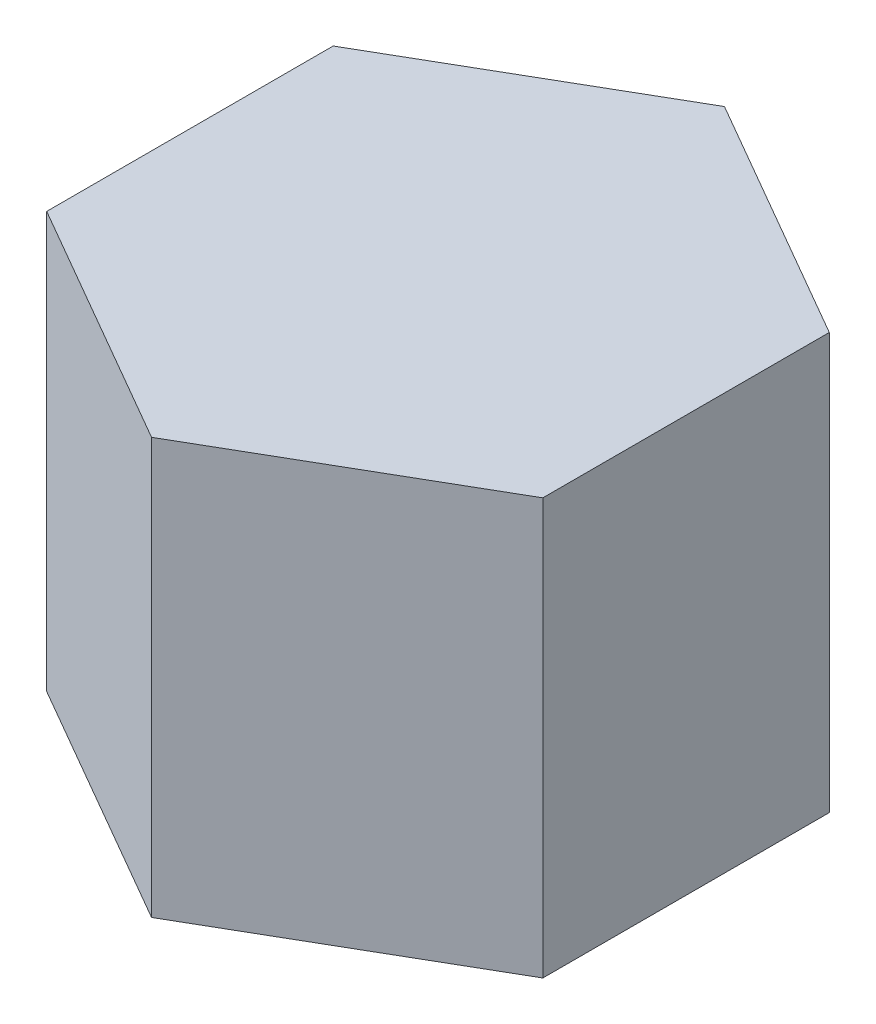
ISO-10303-21;
HEADER;
FILE_DESCRIPTION(('STEP AP214'),'2;1');
FILE_NAME('part.step','',(''),(''),'','','');
FILE_SCHEMA(('AUTOMOTIVE_DESIGN { 1 0 10303 214 1 1 1 1 }'));
ENDSEC;
DATA;
#1=APPLICATION_CONTEXT('core data for automotive mechanical design processes');
#2=APPLICATION_PROTOCOL_DEFINITION('international standard','automotive_design',2000,#1);
#3=PRODUCT_CONTEXT('',#1,'mechanical');
#4=PRODUCT('Part','Part','',(#3));
#5=PRODUCT_RELATED_PRODUCT_CATEGORY('part','',(#4));
#6=PRODUCT_DEFINITION_FORMATION('','',#4);
#7=PRODUCT_DEFINITION_CONTEXT('part definition',#1,'design');
#8=PRODUCT_DEFINITION('design','',#6,#7);
#9=PRODUCT_DEFINITION_SHAPE('','',#8);
#10=(LENGTH_UNIT() NAMED_UNIT(*) SI_UNIT(.MILLI.,.METRE.));
#11=(NAMED_UNIT(*) PLANE_ANGLE_UNIT() SI_UNIT($,.RADIAN.));
#12=(NAMED_UNIT(*) SI_UNIT($,.STERADIAN.) SOLID_ANGLE_UNIT());
#13=UNCERTAINTY_MEASURE_WITH_UNIT(LENGTH_MEASURE(1.E-05),#10,'distance_accuracy_value','');
#14=(GEOMETRIC_REPRESENTATION_CONTEXT(3) GLOBAL_UNCERTAINTY_ASSIGNED_CONTEXT((#13)) GLOBAL_UNIT_ASSIGNED_CONTEXT((#10,
#11,#12)) REPRESENTATION_CONTEXT('',''));
#15=CARTESIAN_POINT('',(0.,0.,0.));
#16=DIRECTION('',(0.,0.,1.));
#17=DIRECTION('',(1.,0.,0.));
#18=AXIS2_PLACEMENT_3D('',#15,#16,#17);
#19=CARTESIAN_POINT('',(206.642660308706,-148.537700895744,288.042869605357));
#20=DIRECTION('',(-0.499999999999943,0.,-0.866025403784472));
#21=DIRECTION('',(-0.866025403784472,0.,0.499999999999943));
#22=AXIS2_PLACEMENT_3D('',#19,#20,#21);
#23=PLANE('',#22);
#24=CARTESIAN_POINT('',(206.339551417382,-149.045793579175,288.217869605357));
#25=DIRECTION('',(0.866025403784471,0.,-0.499999999999943));
#26=VECTOR('',#25,1.);
#27=LINE('',#24,#26);
#28=CARTESIAN_POINT('',(206.339551417382,-149.045793579175,288.217869605357));
#29=VERTEX_POINT('',#28);
#30=CARTESIAN_POINT('',(206.642660308706,-149.045793579175,288.042869605357));
#31=VERTEX_POINT('',#30);
#32=EDGE_CURVE('E170',#29,#31,#27,.T.);
#33=ORIENTED_EDGE('',*,*,#32,.T.);
#34=CARTESIAN_POINT('',(206.642660308706,-148.537700895744,288.042869605357));
#35=DIRECTION('',(0.,-1.,0.));
#36=VECTOR('',#35,1.);
#37=LINE('',#34,#36);
#38=CARTESIAN_POINT('',(206.642660308706,-148.537700895744,288.042869605357));
#39=VERTEX_POINT('',#38);
#40=EDGE_CURVE('E35',#39,#31,#37,.T.);
#41=ORIENTED_EDGE('',*,*,#40,.F.);
#42=CARTESIAN_POINT('',(206.339551417382,-148.537700895744,288.217869605357));
#43=DIRECTION('',(0.866025403784471,0.,-0.499999999999943));
#44=VECTOR('',#43,1.);
#45=LINE('',#42,#44);
#46=CARTESIAN_POINT('',(206.339551417382,-148.537700895744,288.217869605357));
#47=VERTEX_POINT('',#46);
#48=EDGE_CURVE('E159',#47,#39,#45,.T.);
#49=ORIENTED_EDGE('',*,*,#48,.F.);
#50=CARTESIAN_POINT('',(206.339551417382,-148.537700895744,288.217869605357));
#51=DIRECTION('',(0.,-1.,0.));
#52=VECTOR('',#51,1.);
#53=LINE('',#50,#52);
#54=EDGE_CURVE('E10',#47,#29,#53,.T.);
#55=ORIENTED_EDGE('',*,*,#54,.T.);
#56=EDGE_LOOP('',(#33,#41,#49,#55));
#57=FACE_BOUND('',#56,.T.);
#58=ADVANCED_FACE('F16',(#57),#23,.F.);
#59=CARTESIAN_POINT('',(206.339551417382,-148.537700895744,288.217869605357));
#60=DIRECTION('',(0.499999999999978,0.,-0.866025403784452));
#61=DIRECTION('',(-0.866025403784452,0.,-0.499999999999978));
#62=AXIS2_PLACEMENT_3D('',#59,#60,#61);
#63=PLANE('',#62);
#64=CARTESIAN_POINT('',(206.036442526057,-149.045793579175,288.042869605357));
#65=DIRECTION('',(0.866025403784452,0.,0.499999999999978));
#66=VECTOR('',#65,1.);
#67=LINE('',#64,#66);
#68=CARTESIAN_POINT('',(206.036442526057,-149.045793579175,288.042869605357));
#69=VERTEX_POINT('',#68);
#70=EDGE_CURVE('E167',#69,#29,#67,.T.);
#71=ORIENTED_EDGE('',*,*,#70,.T.);
#72=ORIENTED_EDGE('',*,*,#54,.F.);
#73=CARTESIAN_POINT('',(206.036442526057,-148.537700895744,288.042869605357));
#74=DIRECTION('',(0.866025403784452,0.,0.499999999999978));
#75=VECTOR('',#74,1.);
#76=LINE('',#73,#75);
#77=CARTESIAN_POINT('',(206.036442526057,-148.537700895744,288.042869605357));
#78=VERTEX_POINT('',#77);
#79=EDGE_CURVE('E156',#78,#47,#76,.T.);
#80=ORIENTED_EDGE('',*,*,#79,.F.);
#81=CARTESIAN_POINT('',(206.036442526057,-148.537700895744,288.042869605357));
#82=DIRECTION('',(0.,-1.,0.));
#83=VECTOR('',#82,1.);
#84=LINE('',#81,#83);
#85=EDGE_CURVE('E27',#78,#69,#84,.T.);
#86=ORIENTED_EDGE('',*,*,#85,.T.);
#87=EDGE_LOOP('',(#71,#72,#80,#86));
#88=FACE_BOUND('',#87,.T.);
#89=ADVANCED_FACE('F189',(#88),#63,.F.);
#90=CARTESIAN_POINT('',(206.036442526057,-148.537700895744,290.831971220494));
#91=DIRECTION('',(1.,0.,0.));
#92=DIRECTION('',(0.,1.,0.));
#93=AXIS2_PLACEMENT_3D('',#90,#91,#92);
#94=PLANE('',#93);
#95=CARTESIAN_POINT('',(206.036442526057,-149.045793579175,287.692869605357));
#96=DIRECTION('',(0.,0.,1.));
#97=VECTOR('',#96,1.);
#98=LINE('',#95,#97);
#99=CARTESIAN_POINT('',(206.036442526057,-149.045793579175,287.692869605357));
#100=VERTEX_POINT('',#99);
#101=EDGE_CURVE('E163',#100,#69,#98,.T.);
#102=ORIENTED_EDGE('',*,*,#101,.T.);
#103=ORIENTED_EDGE('',*,*,#85,.F.);
#104=CARTESIAN_POINT('',(206.036442526057,-148.537700895744,287.692869605357));
#105=DIRECTION('',(0.,0.,1.));
#106=VECTOR('',#105,1.);
#107=LINE('',#104,#106);
#108=CARTESIAN_POINT('',(206.036442526057,-148.537700895744,287.692869605357));
#109=VERTEX_POINT('',#108);
#110=EDGE_CURVE('E106',#109,#78,#107,.T.);
#111=ORIENTED_EDGE('',*,*,#110,.F.);
#112=CARTESIAN_POINT('',(206.036442526057,-148.537700895744,287.692869605357));
#113=DIRECTION('',(0.,-1.,0.));
#114=VECTOR('',#113,1.);
#115=LINE('',#112,#114);
#116=EDGE_CURVE('E94',#109,#100,#115,.T.);
#117=ORIENTED_EDGE('',*,*,#116,.T.);
#118=EDGE_LOOP('',(#102,#103,#111,#117));
#119=FACE_BOUND('',#118,.T.);
#120=ADVANCED_FACE('F198',(#119),#94,.F.);
#121=CARTESIAN_POINT('',(206.036442526057,-148.537700895744,287.692869605357));
#122=DIRECTION('',(0.499999999999978,0.,0.866025403784452));
#123=DIRECTION('',(0.866025403784452,0.,-0.499999999999978));
#124=AXIS2_PLACEMENT_3D('',#121,#122,#123);
#125=PLANE('',#124);
#126=CARTESIAN_POINT('',(206.339551417382,-149.045793579175,287.517869605357));
#127=DIRECTION('',(-0.866025403784452,0.,0.499999999999978));
#128=VECTOR('',#127,1.);
#129=LINE('',#126,#128);
#130=CARTESIAN_POINT('',(206.339551417382,-149.045793579175,287.517869605357));
#131=VERTEX_POINT('',#130);
#132=EDGE_CURVE('E162',#131,#100,#129,.T.);
#133=ORIENTED_EDGE('',*,*,#132,.T.);
#134=ORIENTED_EDGE('',*,*,#116,.F.);
#135=CARTESIAN_POINT('',(206.339551417382,-148.537700895744,287.517869605357));
#136=DIRECTION('',(-0.866025403784452,0.,0.499999999999978));
#137=VECTOR('',#136,1.);
#138=LINE('',#135,#137);
#139=CARTESIAN_POINT('',(206.339551417382,-148.537700895744,287.517869605357));
#140=VERTEX_POINT('',#139);
#141=EDGE_CURVE('E98',#140,#109,#138,.T.);
#142=ORIENTED_EDGE('',*,*,#141,.F.);
#143=CARTESIAN_POINT('',(206.339551417382,-148.537700895744,287.517869605357));
#144=DIRECTION('',(0.,-1.,0.));
#145=VECTOR('',#144,1.);
#146=LINE('',#143,#145);
#147=EDGE_CURVE('E79',#140,#131,#146,.T.);
#148=ORIENTED_EDGE('',*,*,#147,.T.);
#149=EDGE_LOOP('',(#133,#134,#142,#148));
#150=FACE_BOUND('',#149,.T.);
#151=ADVANCED_FACE('F100',(#150),#125,.F.);
#152=CARTESIAN_POINT('',(206.339551417382,-148.537700895744,287.517869605357));
#153=DIRECTION('',(-0.499999999999943,0.,0.866025403784472));
#154=DIRECTION('',(0.866025403784472,0.,0.499999999999943));
#155=AXIS2_PLACEMENT_3D('',#152,#153,#154);
#156=PLANE('',#155);
#157=CARTESIAN_POINT('',(206.642660308706,-149.045793579175,287.692869605357));
#158=DIRECTION('',(-0.866025403784471,0.,-0.499999999999943));
#159=VECTOR('',#158,1.);
#160=LINE('',#157,#159);
#161=CARTESIAN_POINT('',(206.642660308706,-149.045793579175,287.692869605357));
#162=VERTEX_POINT('',#161);
#163=EDGE_CURVE('E88',#162,#131,#160,.T.);
#164=ORIENTED_EDGE('',*,*,#163,.T.);
#165=ORIENTED_EDGE('',*,*,#147,.F.);
#166=CARTESIAN_POINT('',(206.642660308706,-148.537700895744,287.692869605357));
#167=DIRECTION('',(-0.866025403784471,0.,-0.499999999999943));
#168=VECTOR('',#167,1.);
#169=LINE('',#166,#168);
#170=CARTESIAN_POINT('',(206.642660308706,-148.537700895744,287.692869605357));
#171=VERTEX_POINT('',#170);
#172=EDGE_CURVE('E84',#171,#140,#169,.T.);
#173=ORIENTED_EDGE('',*,*,#172,.F.);
#174=CARTESIAN_POINT('',(206.642660308706,-148.537700895744,287.692869605357));
#175=DIRECTION('',(0.,-1.,0.));
#176=VECTOR('',#175,1.);
#177=LINE('',#174,#176);
#178=EDGE_CURVE('E58',#171,#162,#177,.T.);
#179=ORIENTED_EDGE('',*,*,#178,.T.);
#180=EDGE_LOOP('',(#164,#165,#173,#179));
#181=FACE_BOUND('',#180,.T.);
#182=ADVANCED_FACE('F82',(#181),#156,.F.);
#183=CARTESIAN_POINT('',(206.642660308706,-148.537700895744,290.831971220494));
#184=DIRECTION('',(-1.,0.,0.));
#185=DIRECTION('',(0.,-1.,0.));
#186=AXIS2_PLACEMENT_3D('',#183,#184,#185);
#187=PLANE('',#186);
#188=CARTESIAN_POINT('',(206.642660308706,-149.045793579175,288.042869605357));
#189=DIRECTION('',(0.,0.,-1.));
#190=VECTOR('',#189,1.);
#191=LINE('',#188,#190);
#192=EDGE_CURVE('E160',#31,#162,#191,.T.);
#193=ORIENTED_EDGE('',*,*,#192,.T.);
#194=ORIENTED_EDGE('',*,*,#178,.F.);
#195=CARTESIAN_POINT('',(206.642660308706,-148.537700895744,288.042869605357));
#196=DIRECTION('',(0.,0.,-1.));
#197=VECTOR('',#196,1.);
#198=LINE('',#195,#197);
#199=EDGE_CURVE('E112',#39,#171,#198,.T.);
#200=ORIENTED_EDGE('',*,*,#199,.F.);
#201=ORIENTED_EDGE('',*,*,#40,.T.);
#202=EDGE_LOOP('',(#193,#194,#200,#201));
#203=FACE_BOUND('',#202,.T.);
#204=ADVANCED_FACE('F131',(#203),#187,.F.);
#205=CARTESIAN_POINT('',(206.339551417382,-148.537700895744,290.831971220494));
#206=DIRECTION('',(0.,-1.,0.));
#207=DIRECTION('',(1.,0.,0.));
#208=AXIS2_PLACEMENT_3D('',#205,#206,#207);
#209=PLANE('',#208);
#210=ORIENTED_EDGE('',*,*,#48,.T.);
#211=ORIENTED_EDGE('',*,*,#199,.T.);
#212=ORIENTED_EDGE('',*,*,#172,.T.);
#213=ORIENTED_EDGE('',*,*,#141,.T.);
#214=ORIENTED_EDGE('',*,*,#110,.T.);
#215=ORIENTED_EDGE('',*,*,#79,.T.);
#216=EDGE_LOOP('',(#210,#211,#212,#213,#214,#215));
#217=FACE_BOUND('',#216,.T.);
#218=ADVANCED_FACE('F111',(#217),#209,.F.);
#219=CARTESIAN_POINT('',(206.339551417382,-149.045793579175,290.831971220494));
#220=DIRECTION('',(0.,-1.,0.));
#221=DIRECTION('',(1.,0.,0.));
#222=AXIS2_PLACEMENT_3D('',#219,#220,#221);
#223=PLANE('',#222);
#224=ORIENTED_EDGE('',*,*,#32,.F.);
#225=ORIENTED_EDGE('',*,*,#70,.F.);
#226=ORIENTED_EDGE('',*,*,#101,.F.);
#227=ORIENTED_EDGE('',*,*,#132,.F.);
#228=ORIENTED_EDGE('',*,*,#163,.F.);
#229=ORIENTED_EDGE('',*,*,#192,.F.);
#230=EDGE_LOOP('',(#224,#225,#226,#227,#228,#229));
#231=FACE_BOUND('',#230,.T.);
#232=ADVANCED_FACE('F130',(#231),#223,.T.);
#233=CLOSED_SHELL('',(#58,#89,#120,#151,#182,#204,#218,#232));
#234=MANIFOLD_SOLID_BREP('B1',#233);
#235=ADVANCED_BREP_SHAPE_REPRESENTATION('',(#18,#234),#14);
#236=SHAPE_DEFINITION_REPRESENTATION(#9,#235);
ENDSEC;
END-ISO-10303-21;
